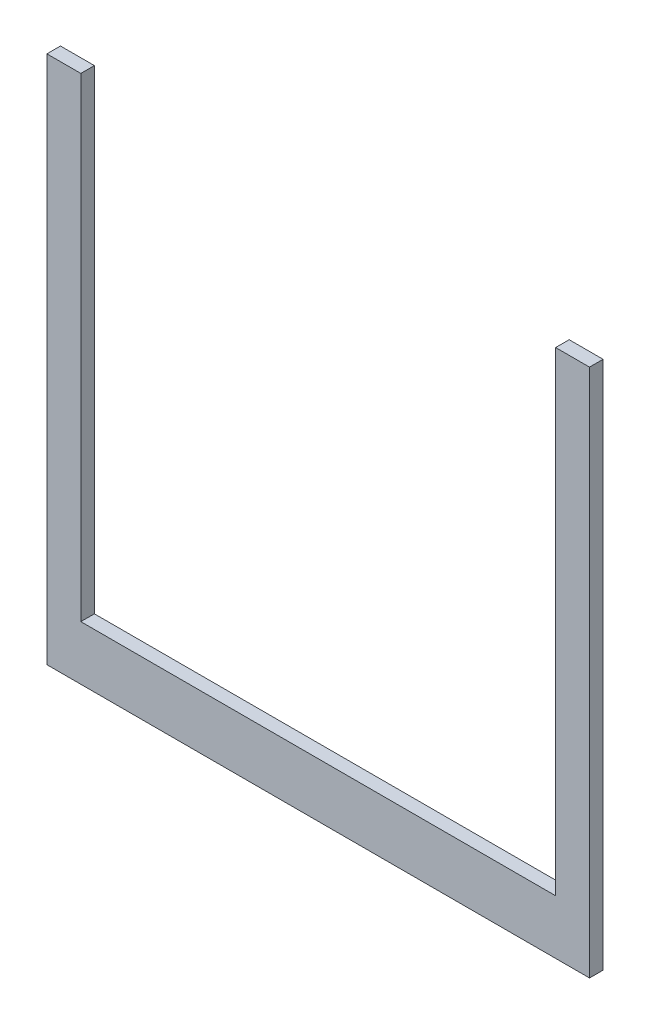
ISO-10303-21;
HEADER;
FILE_DESCRIPTION(('STEP AP214'),'2;1');
FILE_NAME('part.step','',(''),(''),'','','');
FILE_SCHEMA(('AUTOMOTIVE_DESIGN { 1 0 10303 214 1 1 1 1 }'));
ENDSEC;
DATA;
#1=APPLICATION_CONTEXT('core data for automotive mechanical design processes');
#2=APPLICATION_PROTOCOL_DEFINITION('international standard','automotive_design',2000,#1);
#3=PRODUCT_CONTEXT('',#1,'mechanical');
#4=PRODUCT('Part','Part','',(#3));
#5=PRODUCT_RELATED_PRODUCT_CATEGORY('part','',(#4));
#6=PRODUCT_DEFINITION_FORMATION('','',#4);
#7=PRODUCT_DEFINITION_CONTEXT('part definition',#1,'design');
#8=PRODUCT_DEFINITION('design','',#6,#7);
#9=PRODUCT_DEFINITION_SHAPE('','',#8);
#10=(LENGTH_UNIT() NAMED_UNIT(*) SI_UNIT(.MILLI.,.METRE.));
#11=(NAMED_UNIT(*) PLANE_ANGLE_UNIT() SI_UNIT($,.RADIAN.));
#12=(NAMED_UNIT(*) SI_UNIT($,.STERADIAN.) SOLID_ANGLE_UNIT());
#13=UNCERTAINTY_MEASURE_WITH_UNIT(LENGTH_MEASURE(1.E-05),#10,'distance_accuracy_value','');
#14=(GEOMETRIC_REPRESENTATION_CONTEXT(3) GLOBAL_UNCERTAINTY_ASSIGNED_CONTEXT((#13)) GLOBAL_UNIT_ASSIGNED_CONTEXT((#10,
#11,#12)) REPRESENTATION_CONTEXT('',''));
#15=CARTESIAN_POINT('',(0.,0.,0.));
#16=DIRECTION('',(0.,0.,1.));
#17=DIRECTION('',(1.,0.,0.));
#18=AXIS2_PLACEMENT_3D('',#15,#16,#17);
#19=CARTESIAN_POINT('',(0.,0.,10.));
#20=DIRECTION('',(1.,0.,0.));
#21=DIRECTION('',(0.,0.,-1.));
#22=AXIS2_PLACEMENT_3D('',#19,#20,#21);
#23=PLANE('',#22);
#24=DIRECTION('',(0.,-1.,0.));
#25=VECTOR('',#24,1.);
#26=CARTESIAN_POINT('',(0.,0.,0.));
#27=LINE('',#26,#25);
#28=CARTESIAN_POINT('',(0.,390.,0.));
#29=VERTEX_POINT('',#28);
#30=CARTESIAN_POINT('',(0.,0.,0.));
#31=VERTEX_POINT('',#30);
#32=EDGE_CURVE('E128',#29,#31,#27,.T.);
#33=ORIENTED_EDGE('',*,*,#32,.T.);
#34=DIRECTION('',(0.,0.,-1.));
#35=VECTOR('',#34,1.);
#36=CARTESIAN_POINT('',(0.,0.,10.));
#37=LINE('',#36,#35);
#38=CARTESIAN_POINT('',(0.,0.,10.));
#39=VERTEX_POINT('',#38);
#40=EDGE_CURVE('E11',#39,#31,#37,.T.);
#41=ORIENTED_EDGE('',*,*,#40,.F.);
#42=DIRECTION('',(0.,-1.,0.));
#43=VECTOR('',#42,1.);
#44=CARTESIAN_POINT('',(0.,0.,10.));
#45=LINE('',#44,#43);
#46=CARTESIAN_POINT('',(0.,390.,10.));
#47=VERTEX_POINT('',#46);
#48=EDGE_CURVE('E142',#47,#39,#45,.T.);
#49=ORIENTED_EDGE('',*,*,#48,.F.);
#50=DIRECTION('',(0.,0.,-1.));
#51=VECTOR('',#50,1.);
#52=CARTESIAN_POINT('',(0.,390.,10.));
#53=LINE('',#52,#51);
#54=EDGE_CURVE('E124',#47,#29,#53,.T.);
#55=ORIENTED_EDGE('',*,*,#54,.T.);
#56=EDGE_LOOP('',(#33,#41,#49,#55));
#57=FACE_BOUND('',#56,.T.);
#58=ADVANCED_FACE('F32',(#57),#23,.F.);
#59=CARTESIAN_POINT('',(400.,0.,10.));
#60=DIRECTION('',(0.,1.,0.));
#61=DIRECTION('',(-1.,0.,0.));
#62=AXIS2_PLACEMENT_3D('',#59,#60,#61);
#63=PLANE('',#62);
#64=DIRECTION('',(1.,0.,0.));
#65=VECTOR('',#64,1.);
#66=CARTESIAN_POINT('',(400.,0.,0.));
#67=LINE('',#66,#65);
#68=CARTESIAN_POINT('',(400.,0.,0.));
#69=VERTEX_POINT('',#68);
#70=EDGE_CURVE('E131',#31,#69,#67,.T.);
#71=ORIENTED_EDGE('',*,*,#70,.T.);
#72=DIRECTION('',(0.,0.,-1.));
#73=VECTOR('',#72,1.);
#74=CARTESIAN_POINT('',(400.,0.,10.));
#75=LINE('',#74,#73);
#76=CARTESIAN_POINT('',(400.,0.,10.));
#77=VERTEX_POINT('',#76);
#78=EDGE_CURVE('E40',#77,#69,#75,.T.);
#79=ORIENTED_EDGE('',*,*,#78,.F.);
#80=DIRECTION('',(1.,0.,0.));
#81=VECTOR('',#80,1.);
#82=CARTESIAN_POINT('',(400.,0.,10.));
#83=LINE('',#82,#81);
#84=EDGE_CURVE('E91',#39,#77,#83,.T.);
#85=ORIENTED_EDGE('',*,*,#84,.F.);
#86=ORIENTED_EDGE('',*,*,#40,.T.);
#87=EDGE_LOOP('',(#71,#79,#85,#86));
#88=FACE_BOUND('',#87,.T.);
#89=ADVANCED_FACE('F177',(#88),#63,.F.);
#90=CARTESIAN_POINT('',(400.,390.,10.));
#91=DIRECTION('',(-1.,0.,0.));
#92=DIRECTION('',(0.,-1.,0.));
#93=AXIS2_PLACEMENT_3D('',#90,#91,#92);
#94=PLANE('',#93);
#95=DIRECTION('',(0.,1.,0.));
#96=VECTOR('',#95,1.);
#97=CARTESIAN_POINT('',(400.,390.,0.));
#98=LINE('',#97,#96);
#99=CARTESIAN_POINT('',(400.,390.,0.));
#100=VERTEX_POINT('',#99);
#101=EDGE_CURVE('E133',#69,#100,#98,.T.);
#102=ORIENTED_EDGE('',*,*,#101,.T.);
#103=DIRECTION('',(0.,0.,-1.));
#104=VECTOR('',#103,1.);
#105=CARTESIAN_POINT('',(400.,390.,10.));
#106=LINE('',#105,#104);
#107=CARTESIAN_POINT('',(400.,390.,10.));
#108=VERTEX_POINT('',#107);
#109=EDGE_CURVE('E149',#108,#100,#106,.T.);
#110=ORIENTED_EDGE('',*,*,#109,.F.);
#111=DIRECTION('',(0.,1.,0.));
#112=VECTOR('',#111,1.);
#113=CARTESIAN_POINT('',(400.,390.,10.));
#114=LINE('',#113,#112);
#115=EDGE_CURVE('E157',#77,#108,#114,.T.);
#116=ORIENTED_EDGE('',*,*,#115,.F.);
#117=ORIENTED_EDGE('',*,*,#78,.T.);
#118=EDGE_LOOP('',(#102,#110,#116,#117));
#119=FACE_BOUND('',#118,.T.);
#120=ADVANCED_FACE('F155',(#119),#94,.F.);
#121=CARTESIAN_POINT('',(375.,390.,10.));
#122=DIRECTION('',(0.,-1.,0.));
#123=DIRECTION('',(0.,0.,-1.));
#124=AXIS2_PLACEMENT_3D('',#121,#122,#123);
#125=PLANE('',#124);
#126=DIRECTION('',(-1.,0.,0.));
#127=VECTOR('',#126,1.);
#128=CARTESIAN_POINT('',(375.,390.,0.));
#129=LINE('',#128,#127);
#130=CARTESIAN_POINT('',(375.,390.,0.));
#131=VERTEX_POINT('',#130);
#132=EDGE_CURVE('E135',#100,#131,#129,.T.);
#133=ORIENTED_EDGE('',*,*,#132,.T.);
#134=DIRECTION('',(0.,0.,-1.));
#135=VECTOR('',#134,1.);
#136=CARTESIAN_POINT('',(375.,390.,10.));
#137=LINE('',#136,#135);
#138=CARTESIAN_POINT('',(375.,390.,10.));
#139=VERTEX_POINT('',#138);
#140=EDGE_CURVE('E146',#139,#131,#137,.T.);
#141=ORIENTED_EDGE('',*,*,#140,.F.);
#142=DIRECTION('',(-1.,0.,0.));
#143=VECTOR('',#142,1.);
#144=CARTESIAN_POINT('',(375.,390.,10.));
#145=LINE('',#144,#143);
#146=EDGE_CURVE('E169',#108,#139,#145,.T.);
#147=ORIENTED_EDGE('',*,*,#146,.F.);
#148=ORIENTED_EDGE('',*,*,#109,.T.);
#149=EDGE_LOOP('',(#133,#141,#147,#148));
#150=FACE_BOUND('',#149,.T.);
#151=ADVANCED_FACE('F165',(#150),#125,.F.);
#152=CARTESIAN_POINT('',(375.,40.,10.));
#153=DIRECTION('',(1.,0.,0.));
#154=DIRECTION('',(0.,0.,-1.));
#155=AXIS2_PLACEMENT_3D('',#152,#153,#154);
#156=PLANE('',#155);
#157=DIRECTION('',(0.,-1.,0.));
#158=VECTOR('',#157,1.);
#159=CARTESIAN_POINT('',(375.,40.,0.));
#160=LINE('',#159,#158);
#161=CARTESIAN_POINT('',(375.,40.,0.));
#162=VERTEX_POINT('',#161);
#163=EDGE_CURVE('E137',#131,#162,#160,.T.);
#164=ORIENTED_EDGE('',*,*,#163,.T.);
#165=DIRECTION('',(0.,0.,-1.));
#166=VECTOR('',#165,1.);
#167=CARTESIAN_POINT('',(375.,40.,10.));
#168=LINE('',#167,#166);
#169=CARTESIAN_POINT('',(375.,40.,10.));
#170=VERTEX_POINT('',#169);
#171=EDGE_CURVE('E119',#170,#162,#168,.T.);
#172=ORIENTED_EDGE('',*,*,#171,.F.);
#173=DIRECTION('',(0.,-1.,0.));
#174=VECTOR('',#173,1.);
#175=CARTESIAN_POINT('',(375.,40.,10.));
#176=LINE('',#175,#174);
#177=EDGE_CURVE('E110',#139,#170,#176,.T.);
#178=ORIENTED_EDGE('',*,*,#177,.F.);
#179=ORIENTED_EDGE('',*,*,#140,.T.);
#180=EDGE_LOOP('',(#164,#172,#178,#179));
#181=FACE_BOUND('',#180,.T.);
#182=ADVANCED_FACE('F168',(#181),#156,.F.);
#183=CARTESIAN_POINT('',(25.,40.,10.));
#184=DIRECTION('',(0.,-1.,0.));
#185=DIRECTION('',(0.,0.,-1.));
#186=AXIS2_PLACEMENT_3D('',#183,#184,#185);
#187=PLANE('',#186);
#188=DIRECTION('',(-1.,0.,0.));
#189=VECTOR('',#188,1.);
#190=CARTESIAN_POINT('',(25.,40.,0.));
#191=LINE('',#190,#189);
#192=CARTESIAN_POINT('',(25.,40.,0.));
#193=VERTEX_POINT('',#192);
#194=EDGE_CURVE('E118',#162,#193,#191,.T.);
#195=ORIENTED_EDGE('',*,*,#194,.T.);
#196=DIRECTION('',(0.,0.,-1.));
#197=VECTOR('',#196,1.);
#198=CARTESIAN_POINT('',(25.,40.,10.));
#199=LINE('',#198,#197);
#200=CARTESIAN_POINT('',(25.,40.,10.));
#201=VERTEX_POINT('',#200);
#202=EDGE_CURVE('E115',#201,#193,#199,.T.);
#203=ORIENTED_EDGE('',*,*,#202,.F.);
#204=DIRECTION('',(-1.,0.,0.));
#205=VECTOR('',#204,1.);
#206=CARTESIAN_POINT('',(25.,40.,10.));
#207=LINE('',#206,#205);
#208=EDGE_CURVE('E104',#170,#201,#207,.T.);
#209=ORIENTED_EDGE('',*,*,#208,.F.);
#210=ORIENTED_EDGE('',*,*,#171,.T.);
#211=EDGE_LOOP('',(#195,#203,#209,#210));
#212=FACE_BOUND('',#211,.T.);
#213=ADVANCED_FACE('F116',(#212),#187,.F.);
#214=CARTESIAN_POINT('',(25.,390.,10.));
#215=DIRECTION('',(-1.,0.,0.));
#216=DIRECTION('',(0.,-1.,0.));
#217=AXIS2_PLACEMENT_3D('',#214,#215,#216);
#218=PLANE('',#217);
#219=DIRECTION('',(0.,1.,0.));
#220=VECTOR('',#219,1.);
#221=CARTESIAN_POINT('',(25.,390.,0.));
#222=LINE('',#221,#220);
#223=CARTESIAN_POINT('',(25.,390.,0.));
#224=VERTEX_POINT('',#223);
#225=EDGE_CURVE('E77',#193,#224,#222,.T.);
#226=ORIENTED_EDGE('',*,*,#225,.T.);
#227=DIRECTION('',(0.,0.,-1.));
#228=VECTOR('',#227,1.);
#229=CARTESIAN_POINT('',(25.,390.,10.));
#230=LINE('',#229,#228);
#231=CARTESIAN_POINT('',(25.,390.,10.));
#232=VERTEX_POINT('',#231);
#233=EDGE_CURVE('E120',#232,#224,#230,.T.);
#234=ORIENTED_EDGE('',*,*,#233,.F.);
#235=DIRECTION('',(0.,1.,0.));
#236=VECTOR('',#235,1.);
#237=CARTESIAN_POINT('',(25.,390.,10.));
#238=LINE('',#237,#236);
#239=EDGE_CURVE('E108',#201,#232,#238,.T.);
#240=ORIENTED_EDGE('',*,*,#239,.F.);
#241=ORIENTED_EDGE('',*,*,#202,.T.);
#242=EDGE_LOOP('',(#226,#234,#240,#241));
#243=FACE_BOUND('',#242,.T.);
#244=ADVANCED_FACE('F122',(#243),#218,.F.);
#245=CARTESIAN_POINT('',(0.,390.,10.));
#246=DIRECTION('',(0.,-1.,0.));
#247=DIRECTION('',(0.,0.,-1.));
#248=AXIS2_PLACEMENT_3D('',#245,#246,#247);
#249=PLANE('',#248);
#250=DIRECTION('',(-1.,0.,0.));
#251=VECTOR('',#250,1.);
#252=CARTESIAN_POINT('',(0.,390.,0.));
#253=LINE('',#252,#251);
#254=EDGE_CURVE('E83',#224,#29,#253,.T.);
#255=ORIENTED_EDGE('',*,*,#254,.T.);
#256=ORIENTED_EDGE('',*,*,#54,.F.);
#257=DIRECTION('',(-1.,0.,0.));
#258=VECTOR('',#257,1.);
#259=CARTESIAN_POINT('',(0.,390.,10.));
#260=LINE('',#259,#258);
#261=EDGE_CURVE('E48',#232,#47,#260,.T.);
#262=ORIENTED_EDGE('',*,*,#261,.F.);
#263=ORIENTED_EDGE('',*,*,#233,.T.);
#264=EDGE_LOOP('',(#255,#256,#262,#263));
#265=FACE_BOUND('',#264,.T.);
#266=ADVANCED_FACE('F193',(#265),#249,.F.);
#267=CARTESIAN_POINT('',(0.,0.,10.));
#268=DIRECTION('',(0.,0.,-1.));
#269=DIRECTION('',(-1.,0.,0.));
#270=AXIS2_PLACEMENT_3D('',#267,#268,#269);
#271=PLANE('',#270);
#272=ORIENTED_EDGE('',*,*,#48,.T.);
#273=ORIENTED_EDGE('',*,*,#84,.T.);
#274=ORIENTED_EDGE('',*,*,#115,.T.);
#275=ORIENTED_EDGE('',*,*,#146,.T.);
#276=ORIENTED_EDGE('',*,*,#177,.T.);
#277=ORIENTED_EDGE('',*,*,#208,.T.);
#278=ORIENTED_EDGE('',*,*,#239,.T.);
#279=ORIENTED_EDGE('',*,*,#261,.T.);
#280=EDGE_LOOP('',(#272,#273,#274,#275,#276,#277,#278,#279));
#281=FACE_BOUND('',#280,.T.);
#282=ADVANCED_FACE('F106',(#281),#271,.F.);
#283=CARTESIAN_POINT('',(0.,0.,0.));
#284=DIRECTION('',(0.,0.,-1.));
#285=DIRECTION('',(-1.,0.,0.));
#286=AXIS2_PLACEMENT_3D('',#283,#284,#285);
#287=PLANE('',#286);
#288=ORIENTED_EDGE('',*,*,#32,.F.);
#289=ORIENTED_EDGE('',*,*,#254,.F.);
#290=ORIENTED_EDGE('',*,*,#225,.F.);
#291=ORIENTED_EDGE('',*,*,#194,.F.);
#292=ORIENTED_EDGE('',*,*,#163,.F.);
#293=ORIENTED_EDGE('',*,*,#132,.F.);
#294=ORIENTED_EDGE('',*,*,#101,.F.);
#295=ORIENTED_EDGE('',*,*,#70,.F.);
#296=EDGE_LOOP('',(#288,#289,#290,#291,#292,#293,#294,#295));
#297=FACE_BOUND('',#296,.T.);
#298=ADVANCED_FACE('F161',(#297),#287,.T.);
#299=CLOSED_SHELL('',(#58,#89,#120,#151,#182,#213,#244,#266,#282,#298));
#300=MANIFOLD_SOLID_BREP('B2',#299);
#301=ADVANCED_BREP_SHAPE_REPRESENTATION('',(#18,#300),#14);
#302=SHAPE_DEFINITION_REPRESENTATION(#9,#301);
ENDSEC;
END-ISO-10303-21;
